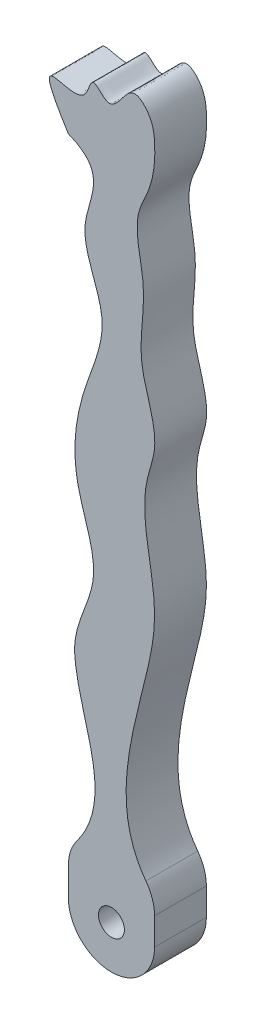
ISO-10303-21;
HEADER;
FILE_DESCRIPTION(('STEP AP214'),'2;1');
FILE_NAME('part.step','',(''),(''),'','','');
FILE_SCHEMA(('AUTOMOTIVE_DESIGN { 1 0 10303 214 1 1 1 1 }'));
ENDSEC;
DATA;
#1=APPLICATION_CONTEXT('core data for automotive mechanical design processes');
#2=APPLICATION_PROTOCOL_DEFINITION('international standard','automotive_design',2000,#1);
#3=PRODUCT_CONTEXT('',#1,'mechanical');
#4=PRODUCT('Part','Part','',(#3));
#5=PRODUCT_RELATED_PRODUCT_CATEGORY('part','',(#4));
#6=PRODUCT_DEFINITION_FORMATION('','',#4);
#7=PRODUCT_DEFINITION_CONTEXT('part definition',#1,'design');
#8=PRODUCT_DEFINITION('design','',#6,#7);
#9=PRODUCT_DEFINITION_SHAPE('','',#8);
#10=(LENGTH_UNIT() NAMED_UNIT(*) SI_UNIT(.MILLI.,.METRE.));
#11=(NAMED_UNIT(*) PLANE_ANGLE_UNIT() SI_UNIT($,.RADIAN.));
#12=(NAMED_UNIT(*) SI_UNIT($,.STERADIAN.) SOLID_ANGLE_UNIT());
#13=UNCERTAINTY_MEASURE_WITH_UNIT(LENGTH_MEASURE(1.E-05),#10,'distance_accuracy_value','');
#14=(GEOMETRIC_REPRESENTATION_CONTEXT(3) GLOBAL_UNCERTAINTY_ASSIGNED_CONTEXT((#13)) GLOBAL_UNIT_ASSIGNED_CONTEXT((#10,
#11,#12)) REPRESENTATION_CONTEXT('',''));
#15=CARTESIAN_POINT('',(0.,0.,0.));
#16=DIRECTION('',(0.,0.,1.));
#17=DIRECTION('',(1.,0.,0.));
#18=AXIS2_PLACEMENT_3D('',#15,#16,#17);
#19=CARTESIAN_POINT('',(4.07432307287909,27.0040889400727,6.));
#20=DIRECTION('',(0.,0.,1.));
#21=DIRECTION('',(1.,0.,0.));
#22=AXIS2_PLACEMENT_3D('',#19,#20,#21);
#23=PLANE('',#22);
#24=CARTESIAN_POINT('',(4.99,-4.99,6.));
#25=DIRECTION('',(0.,0.,1.));
#26=DIRECTION('',(1.,0.,0.));
#27=AXIS2_PLACEMENT_3D('',#24,#25,#26);
#28=CIRCLE('',#27,1.5);
#29=CARTESIAN_POINT('',(6.49,-4.99,6.));
#30=VERTEX_POINT('',#29);
#31=EDGE_CURVE('E267',#30,#30,#28,.T.);
#32=ORIENTED_EDGE('',*,*,#31,.F.);
#33=EDGE_LOOP('',(#32));
#34=FACE_BOUND('',#33,.T.);
#35=DIRECTION('',(0.,1.,0.));
#36=VECTOR('',#35,1.);
#37=CARTESIAN_POINT('',(9.98,0.,6.));
#38=LINE('',#37,#36);
#39=CARTESIAN_POINT('',(9.98,-4.99,6.));
#40=VERTEX_POINT('',#39);
#41=CARTESIAN_POINT('',(9.98,-1.84366873367898,6.));
#42=VERTEX_POINT('',#41);
#43=EDGE_CURVE('E143',#40,#42,#38,.T.);
#44=ORIENTED_EDGE('',*,*,#43,.T.);
#45=CARTESIAN_POINT('',(4.98,-1.84366873367898,6.));
#46=DIRECTION('',(0.,0.,1.));
#47=DIRECTION('',(1.,0.,0.));
#48=AXIS2_PLACEMENT_3D('',#45,#46,#47);
#49=CIRCLE('',#48,5.);
#50=CARTESIAN_POINT('',(8.98098100878048,1.15502280887385,6.));
#51=VERTEX_POINT('',#50);
#52=EDGE_CURVE('E299',#42,#51,#49,.T.);
#53=ORIENTED_EDGE('',*,*,#52,.T.);
#54=CARTESIAN_POINT('',(0.,71.5650155719996,6.));
#55=CARTESIAN_POINT('',(-5.23348107052587,79.9076116564832,6.));
#56=CARTESIAN_POINT('',(1.76861581274312,73.0948712639177,6.));
#57=CARTESIAN_POINT('',(2.67028692862513,79.1568770275505,6.));
#58=CARTESIAN_POINT('',(5.22304293118502,75.3266328469316,6.));
#59=CARTESIAN_POINT('',(6.95630672094599,80.779428566184,6.));
#60=CARTESIAN_POINT('',(9.7237738299482,77.9960982388825,6.));
#61=CARTESIAN_POINT('',(10.1600572462268,74.8960421468875,6.));
#62=CARTESIAN_POINT('',(9.84483703790709,71.2010889508699,6.));
#63=CARTESIAN_POINT('',(7.18888822312384,66.6374369105406,6.));
#64=CARTESIAN_POINT('',(9.49319090001314,60.3691965149892,6.));
#65=CARTESIAN_POINT('',(7.47094063330744,52.8017717005574,6.));
#66=CARTESIAN_POINT('',(10.8925576927519,46.3282596734939,6.));
#67=CARTESIAN_POINT('',(7.67948493558091,38.4277530219315,6.));
#68=CARTESIAN_POINT('',(10.9607769378451,30.1273973636887,6.));
#69=CARTESIAN_POINT('',(7.84195569530145,16.6039575659587,6.));
#70=CARTESIAN_POINT('',(4.62250046719013,5.40141243116943,6.));
#71=CARTESIAN_POINT('',(9.97999999999999,0.,6.));
#72=B_SPLINE_CURVE_WITH_KNOTS('',3,(#54,#55,#56,#57,#58,#59,#60,#61,#62,#63,#64,#65,#66,#67,#68,
#69,#70,#71),.UNSPECIFIED.,.F.,.F.,(4,1,1,1,1,1,1,1,1,1,1,1,1,1,1,4),(0.,0.0748046004819373,
0.0943656239613911,0.114748154482906,0.154560578283164,0.178597200692737,0.20232402340862,
0.255569531192657,0.28854750507143,0.360702051299538,0.443388281836509,0.525057153622352,
0.564586382830383,0.697373731389165,0.77628332170053,1.),.UNSPECIFIED.);
#73=CARTESIAN_POINT('',(9.98,28.1320456499708,6.));
#74=VERTEX_POINT('',#73);
#75=EDGE_CURVE('E202',#74,#51,#72,.T.);
#76=ORIENTED_EDGE('',*,*,#75,.F.);
#77=CARTESIAN_POINT('',(9.98,28.5122713338614,6.));
#78=CARTESIAN_POINT('',(9.98149863752208,28.385388264433,6.));
#79=CARTESIAN_POINT('',(9.98147607811895,28.2586541660967,6.));
#80=CARTESIAN_POINT('',(9.97999999999932,28.1320456499708,6.));
#81=B_SPLINE_CURVE_WITH_KNOTS('',3,(#77,#78,#79,#80),.UNSPECIFIED.,.F.,.F.,(4,4),
(0.298635868241471,0.302626268610835),.UNSPECIFIED.);
#82=CARTESIAN_POINT('',(9.98,28.5122713338714,6.));
#83=VERTEX_POINT('',#82);
#84=EDGE_CURVE('E151',#74,#83,#81,.F.);
#85=ORIENTED_EDGE('',*,*,#84,.T.);
#86=CARTESIAN_POINT('',(9.98,0.,6.));
#87=CARTESIAN_POINT('',(4.62250046719011,5.40141243116942,6.));
#88=CARTESIAN_POINT('',(7.84195569530145,16.6039575659587,6.));
#89=CARTESIAN_POINT('',(10.9607769378451,30.1273973636887,6.));
#90=CARTESIAN_POINT('',(7.67948493558091,38.4277530219314,6.));
#91=CARTESIAN_POINT('',(10.8925576927519,46.3282596734939,6.));
#92=CARTESIAN_POINT('',(7.47094063330744,52.8017717005574,6.));
#93=CARTESIAN_POINT('',(9.49319090001314,60.3691965149892,6.));
#94=CARTESIAN_POINT('',(7.18888822312384,66.6374369105406,6.));
#95=CARTESIAN_POINT('',(9.8448370379071,71.2010889508699,6.));
#96=CARTESIAN_POINT('',(10.1600572462268,74.8960421468876,6.));
#97=CARTESIAN_POINT('',(9.7237738299482,77.9960982388825,6.));
#98=CARTESIAN_POINT('',(6.95630672094599,80.779428566184,6.));
#99=CARTESIAN_POINT('',(5.22304293118502,75.3266328469316,6.));
#100=CARTESIAN_POINT('',(2.67028692862513,79.1568770275505,6.));
#101=CARTESIAN_POINT('',(1.76861581274311,73.0948712639177,6.));
#102=CARTESIAN_POINT('',(-5.23348107052587,79.9076116564831,6.));
#103=CARTESIAN_POINT('',(0.,71.5650155719996,6.));
#104=B_SPLINE_CURVE_WITH_KNOTS('',3,(#86,#87,#88,#89,#90,#91,#92,#93,#94,#95,#96,#97,#98,#99,
#100,#101,#102,#103),.UNSPECIFIED.,.F.,.F.,(4,1,1,1,1,1,1,1,1,1,1,1,1,1,1,4),(0.,
0.22371667829947,0.302626268610835,0.435413617169617,0.474942846377647,0.556611718163491,
0.639297948700462,0.71145249492857,0.744430468807343,0.79767597659138,0.821402799307263,
0.845439421716837,0.885251845517094,0.905634376038609,0.925195399518063,1.),.UNSPECIFIED.);
#105=CARTESIAN_POINT('',(0.,71.5650155719996,6.));
#106=VERTEX_POINT('',#105);
#107=EDGE_CURVE('E230',#83,#106,#104,.T.);
#108=ORIENTED_EDGE('',*,*,#107,.T.);
#109=CARTESIAN_POINT('',(0.,71.5650155719996,6.));
#110=CARTESIAN_POINT('',(4.95379874150826,69.5878986572499,6.));
#111=CARTESIAN_POINT('',(-0.349346036381591,63.4928346008607,6.));
#112=CARTESIAN_POINT('',(5.46747409240744,55.1455661347434,6.));
#113=CARTESIAN_POINT('',(1.27242754081739,46.5750249363635,6.));
#114=CARTESIAN_POINT('',(-0.0166340129952795,37.4764347168597,6.));
#115=CARTESIAN_POINT('',(4.50908777851613,28.7822913087027,6.));
#116=CARTESIAN_POINT('',(0.375030838020541,22.6222597257897,6.));
#117=CARTESIAN_POINT('',(1.48893672285423,12.7256065749913,6.));
#118=CARTESIAN_POINT('',(5.63606805971561,6.03124587861794,6.));
#119=CARTESIAN_POINT('',(0.,0.,6.));
#120=B_SPLINE_CURVE_WITH_KNOTS('',3,(#109,#110,#111,#112,#113,#114,#115,#116,#117,#118,#119),
.UNSPECIFIED.,.F.,.F.,(4,1,1,1,1,1,1,1,4),(0.,0.126258818588464,0.238720386188479,
0.351181953788495,0.484025061415551,0.603344795023398,0.708762825580807,0.749079210393112,1.),.UNSPECIFIED.);
#121=CARTESIAN_POINT('',(0.993222974569181,1.18325505641431,6.));
#122=VERTEX_POINT('',#121);
#123=EDGE_CURVE('E222',#106,#122,#120,.T.);
#124=ORIENTED_EDGE('',*,*,#123,.T.);
#125=CARTESIAN_POINT('',(5.,-1.80768758236695,6.));
#126=DIRECTION('',(0.,0.,1.));
#127=DIRECTION('',(1.,0.,0.));
#128=AXIS2_PLACEMENT_3D('',#125,#126,#127);
#129=CIRCLE('',#128,5.);
#130=CARTESIAN_POINT('',(0.,-1.80768758236695,6.));
#131=VERTEX_POINT('',#130);
#132=EDGE_CURVE('E68',#122,#131,#129,.T.);
#133=ORIENTED_EDGE('',*,*,#132,.T.);
#134=DIRECTION('',(0.,-1.,0.));
#135=VECTOR('',#134,1.);
#136=CARTESIAN_POINT('',(0.,0.,6.));
#137=LINE('',#136,#135);
#138=CARTESIAN_POINT('',(0.,-4.99,6.));
#139=VERTEX_POINT('',#138);
#140=EDGE_CURVE('E148',#131,#139,#137,.T.);
#141=ORIENTED_EDGE('',*,*,#140,.T.);
#142=CARTESIAN_POINT('',(4.99,-4.99,6.));
#143=DIRECTION('',(0.,0.,1.));
#144=DIRECTION('',(1.,0.,0.));
#145=AXIS2_PLACEMENT_3D('',#142,#143,#144);
#146=CIRCLE('',#145,4.99);
#147=EDGE_CURVE('E135',#139,#40,#146,.T.);
#148=ORIENTED_EDGE('',*,*,#147,.T.);
#149=EDGE_LOOP('',(#44,#53,#76,#85,#108,#124,#133,#141,#148));
#150=FACE_BOUND('',#149,.T.);
#151=ADVANCED_FACE('F53',(#34,#150),#23,.T.);
#152=CARTESIAN_POINT('',(4.07432307287909,27.0040889400727,0.));
#153=DIRECTION('',(0.,0.,1.));
#154=DIRECTION('',(1.,0.,0.));
#155=AXIS2_PLACEMENT_3D('',#152,#153,#154);
#156=PLANE('',#155);
#157=CARTESIAN_POINT('',(4.99,-4.99,0.));
#158=DIRECTION('',(0.,0.,1.));
#159=DIRECTION('',(1.,0.,0.));
#160=AXIS2_PLACEMENT_3D('',#157,#158,#159);
#161=CIRCLE('',#160,1.5);
#162=CARTESIAN_POINT('',(6.49,-4.99,0.));
#163=VERTEX_POINT('',#162);
#164=EDGE_CURVE('E265',#163,#163,#161,.T.);
#165=ORIENTED_EDGE('',*,*,#164,.T.);
#166=EDGE_LOOP('',(#165));
#167=FACE_BOUND('',#166,.T.);
#168=CARTESIAN_POINT('',(0.,71.5650155719996,0.));
#169=CARTESIAN_POINT('',(-5.23348107052587,79.9076116564832,0.));
#170=CARTESIAN_POINT('',(1.76861581274312,73.0948712639177,0.));
#171=CARTESIAN_POINT('',(2.67028692862513,79.1568770275505,0.));
#172=CARTESIAN_POINT('',(5.22304293118502,75.3266328469316,0.));
#173=CARTESIAN_POINT('',(6.95630672094599,80.779428566184,0.));
#174=CARTESIAN_POINT('',(9.7237738299482,77.9960982388825,0.));
#175=CARTESIAN_POINT('',(10.1600572462268,74.8960421468875,0.));
#176=CARTESIAN_POINT('',(9.84483703790709,71.2010889508699,0.));
#177=CARTESIAN_POINT('',(7.18888822312384,66.6374369105406,0.));
#178=CARTESIAN_POINT('',(9.49319090001314,60.3691965149892,0.));
#179=CARTESIAN_POINT('',(7.47094063330744,52.8017717005574,0.));
#180=CARTESIAN_POINT('',(10.8925576927519,46.3282596734939,0.));
#181=CARTESIAN_POINT('',(7.67948493558091,38.4277530219315,0.));
#182=CARTESIAN_POINT('',(10.9607769378451,30.1273973636887,0.));
#183=CARTESIAN_POINT('',(7.84195569530145,16.6039575659587,0.));
#184=CARTESIAN_POINT('',(4.62250046719013,5.40141243116943,0.));
#185=CARTESIAN_POINT('',(9.97999999999999,0.,0.));
#186=B_SPLINE_CURVE_WITH_KNOTS('',3,(#168,#169,#170,#171,#172,#173,#174,#175,#176,#177,#178,
#179,#180,#181,#182,#183,#184,#185),.UNSPECIFIED.,.F.,.F.,(4,1,1,1,1,1,1,1,1,1,1,1,1,1,1,4),(0.,
0.0748046004819373,0.0943656239613911,0.114748154482906,0.154560578283164,0.178597200692737,
0.20232402340862,0.255569531192657,0.28854750507143,0.360702051299538,0.443388281836509,
0.525057153622352,0.564586382830383,0.697373731389165,0.77628332170053,1.),.UNSPECIFIED.);
#187=CARTESIAN_POINT('',(9.97999999999932,28.1320456499708,0.));
#188=VERTEX_POINT('',#187);
#189=CARTESIAN_POINT('',(8.98098100878048,1.15502280887385,0.));
#190=VERTEX_POINT('',#189);
#191=EDGE_CURVE('E195',#188,#190,#186,.T.);
#192=ORIENTED_EDGE('',*,*,#191,.T.);
#193=CARTESIAN_POINT('',(4.98,-1.84366873367898,0.));
#194=DIRECTION('',(0.,0.,1.));
#195=DIRECTION('',(1.,0.,0.));
#196=AXIS2_PLACEMENT_3D('',#193,#194,#195);
#197=CIRCLE('',#196,5.);
#198=CARTESIAN_POINT('',(9.98,-1.84366873367898,0.));
#199=VERTEX_POINT('',#198);
#200=EDGE_CURVE('E147',#190,#199,#197,.F.);
#201=ORIENTED_EDGE('',*,*,#200,.T.);
#202=DIRECTION('',(0.,1.,0.));
#203=VECTOR('',#202,1.);
#204=CARTESIAN_POINT('',(9.98,0.,0.));
#205=LINE('',#204,#203);
#206=CARTESIAN_POINT('',(9.98,-4.99,0.));
#207=VERTEX_POINT('',#206);
#208=EDGE_CURVE('E140',#207,#199,#205,.T.);
#209=ORIENTED_EDGE('',*,*,#208,.F.);
#210=CARTESIAN_POINT('',(4.99,-4.99,0.));
#211=DIRECTION('',(0.,0.,1.));
#212=DIRECTION('',(1.,0.,0.));
#213=AXIS2_PLACEMENT_3D('',#210,#211,#212);
#214=CIRCLE('',#213,4.99);
#215=CARTESIAN_POINT('',(0.,-4.99,0.));
#216=VERTEX_POINT('',#215);
#217=EDGE_CURVE('E124',#216,#207,#214,.T.);
#218=ORIENTED_EDGE('',*,*,#217,.F.);
#219=DIRECTION('',(0.,-1.,0.));
#220=VECTOR('',#219,1.);
#221=CARTESIAN_POINT('',(0.,0.,0.));
#222=LINE('',#221,#220);
#223=CARTESIAN_POINT('',(0.,-1.80768758236695,0.));
#224=VERTEX_POINT('',#223);
#225=EDGE_CURVE('E154',#224,#216,#222,.T.);
#226=ORIENTED_EDGE('',*,*,#225,.F.);
#227=CARTESIAN_POINT('',(5.,-1.80768758236695,0.));
#228=DIRECTION('',(0.,0.,1.));
#229=DIRECTION('',(1.,0.,0.));
#230=AXIS2_PLACEMENT_3D('',#227,#228,#229);
#231=CIRCLE('',#230,5.);
#232=CARTESIAN_POINT('',(0.993222974569181,1.18325505641431,0.));
#233=VERTEX_POINT('',#232);
#234=EDGE_CURVE('E292',#224,#233,#231,.F.);
#235=ORIENTED_EDGE('',*,*,#234,.T.);
#236=CARTESIAN_POINT('',(0.,71.5650155719996,0.));
#237=CARTESIAN_POINT('',(4.95379874150826,69.5878986572499,0.));
#238=CARTESIAN_POINT('',(-0.349346036381591,63.4928346008607,0.));
#239=CARTESIAN_POINT('',(5.46747409240744,55.1455661347434,0.));
#240=CARTESIAN_POINT('',(1.27242754081739,46.5750249363635,0.));
#241=CARTESIAN_POINT('',(-0.0166340129952795,37.4764347168597,0.));
#242=CARTESIAN_POINT('',(4.50908777851613,28.7822913087027,0.));
#243=CARTESIAN_POINT('',(0.375030838020541,22.6222597257897,0.));
#244=CARTESIAN_POINT('',(1.48893672285423,12.7256065749913,0.));
#245=CARTESIAN_POINT('',(5.63606805971561,6.03124587861794,0.));
#246=CARTESIAN_POINT('',(0.,0.,0.));
#247=B_SPLINE_CURVE_WITH_KNOTS('',3,(#236,#237,#238,#239,#240,#241,#242,#243,#244,#245,#246),
.UNSPECIFIED.,.F.,.F.,(4,1,1,1,1,1,1,1,4),(0.,0.126258818588464,0.238720386188479,
0.351181953788495,0.484025061415551,0.603344795023398,0.708762825580807,0.749079210393112,1.),.UNSPECIFIED.);
#248=CARTESIAN_POINT('',(0.,71.5650155719996,0.));
#249=VERTEX_POINT('',#248);
#250=EDGE_CURVE('E213',#249,#233,#247,.T.);
#251=ORIENTED_EDGE('',*,*,#250,.F.);
#252=CARTESIAN_POINT('',(9.98,0.,0.));
#253=CARTESIAN_POINT('',(4.62250046719011,5.40141243116942,0.));
#254=CARTESIAN_POINT('',(7.84195569530145,16.6039575659587,0.));
#255=CARTESIAN_POINT('',(10.9607769378451,30.1273973636887,0.));
#256=CARTESIAN_POINT('',(7.67948493558091,38.4277530219314,0.));
#257=CARTESIAN_POINT('',(10.8925576927519,46.3282596734939,0.));
#258=CARTESIAN_POINT('',(7.47094063330744,52.8017717005574,0.));
#259=CARTESIAN_POINT('',(9.49319090001314,60.3691965149892,0.));
#260=CARTESIAN_POINT('',(7.18888822312384,66.6374369105406,0.));
#261=CARTESIAN_POINT('',(9.8448370379071,71.2010889508699,0.));
#262=CARTESIAN_POINT('',(10.1600572462268,74.8960421468876,0.));
#263=CARTESIAN_POINT('',(9.7237738299482,77.9960982388825,0.));
#264=CARTESIAN_POINT('',(6.95630672094599,80.779428566184,0.));
#265=CARTESIAN_POINT('',(5.22304293118502,75.3266328469316,0.));
#266=CARTESIAN_POINT('',(2.67028692862513,79.1568770275505,0.));
#267=CARTESIAN_POINT('',(1.76861581274311,73.0948712639177,0.));
#268=CARTESIAN_POINT('',(-5.23348107052587,79.9076116564831,0.));
#269=CARTESIAN_POINT('',(0.,71.5650155719996,0.));
#270=B_SPLINE_CURVE_WITH_KNOTS('',3,(#252,#253,#254,#255,#256,#257,#258,#259,#260,#261,#262,
#263,#264,#265,#266,#267,#268,#269),.UNSPECIFIED.,.F.,.F.,(4,1,1,1,1,1,1,1,1,1,1,1,1,1,1,4),(0.,
0.22371667829947,0.302626268610835,0.435413617169617,0.474942846377647,0.556611718163491,
0.639297948700462,0.71145249492857,0.744430468807343,0.79767597659138,0.821402799307263,
0.845439421716837,0.885251845517094,0.905634376038609,0.925195399518063,1.),.UNSPECIFIED.);
#271=CARTESIAN_POINT('',(9.98,28.512271333938,0.));
#272=VERTEX_POINT('',#271);
#273=EDGE_CURVE('E214',#272,#249,#270,.T.);
#274=ORIENTED_EDGE('',*,*,#273,.F.);
#275=CARTESIAN_POINT('',(9.97999999999932,28.1320456499708,0.));
#276=CARTESIAN_POINT('',(9.98147607811895,28.2586541660967,0.));
#277=CARTESIAN_POINT('',(9.98149863752208,28.385388264433,0.));
#278=CARTESIAN_POINT('',(9.98,28.5122713338614,0.));
#279=B_SPLINE_CURVE_WITH_KNOTS('',3,(#275,#276,#277,#278),.UNSPECIFIED.,.F.,.F.,(4,4),
(0.298635868241471,0.302626268610835),.UNSPECIFIED.);
#280=EDGE_CURVE('E149',#188,#272,#279,.T.);
#281=ORIENTED_EDGE('',*,*,#280,.F.);
#282=EDGE_LOOP('',(#192,#201,#209,#218,#226,#235,#251,#274,#281));
#283=FACE_BOUND('',#282,.T.);
#284=ADVANCED_FACE('F146',(#167,#283),#156,.F.);
#285=CARTESIAN_POINT('',(9.98,0.,6.));
#286=DIRECTION('',(-1.,0.,0.));
#287=DIRECTION('',(0.,0.,1.));
#288=AXIS2_PLACEMENT_3D('',#285,#286,#287);
#289=PLANE('',#288);
#290=ORIENTED_EDGE('',*,*,#208,.T.);
#291=DIRECTION('',(0.,0.,-1.));
#292=VECTOR('',#291,1.);
#293=CARTESIAN_POINT('',(9.98,-1.84366873367898,6.));
#294=LINE('',#293,#292);
#295=EDGE_CURVE('E294',#199,#42,#294,.F.);
#296=ORIENTED_EDGE('',*,*,#295,.T.);
#297=ORIENTED_EDGE('',*,*,#43,.F.);
#298=DIRECTION('',(0.,0.,1.));
#299=VECTOR('',#298,1.);
#300=CARTESIAN_POINT('',(9.98,-4.99,0.));
#301=LINE('',#300,#299);
#302=EDGE_CURVE('E128',#207,#40,#301,.T.);
#303=ORIENTED_EDGE('',*,*,#302,.F.);
#304=EDGE_LOOP('',(#290,#296,#297,#303));
#305=FACE_BOUND('',#304,.T.);
#306=ADVANCED_FACE('F139',(#305),#289,.F.);
#307=CARTESIAN_POINT('',(0.,0.,6.));
#308=DIRECTION('',(1.,0.,0.));
#309=DIRECTION('',(0.,1.,0.));
#310=AXIS2_PLACEMENT_3D('',#307,#308,#309);
#311=PLANE('',#310);
#312=ORIENTED_EDGE('',*,*,#140,.F.);
#313=DIRECTION('',(0.,0.,-1.));
#314=VECTOR('',#313,1.);
#315=CARTESIAN_POINT('',(0.,-1.80768758236695,6.));
#316=LINE('',#315,#314);
#317=EDGE_CURVE('E61',#131,#224,#316,.T.);
#318=ORIENTED_EDGE('',*,*,#317,.T.);
#319=ORIENTED_EDGE('',*,*,#225,.T.);
#320=DIRECTION('',(0.,0.,1.));
#321=VECTOR('',#320,1.);
#322=CARTESIAN_POINT('',(0.,-4.99,0.));
#323=LINE('',#322,#321);
#324=EDGE_CURVE('E131',#216,#139,#323,.T.);
#325=ORIENTED_EDGE('',*,*,#324,.T.);
#326=EDGE_LOOP('',(#312,#318,#319,#325));
#327=FACE_BOUND('',#326,.T.);
#328=ADVANCED_FACE('F303',(#327),#311,.F.);
#329=CARTESIAN_POINT('',(4.99,-4.99,6.));
#330=DIRECTION('',(0.,0.,-1.));
#331=DIRECTION('',(-1.,0.,0.));
#332=AXIS2_PLACEMENT_3D('',#329,#330,#331);
#333=CYLINDRICAL_SURFACE('',#332,1.5);
#334=ORIENTED_EDGE('',*,*,#31,.T.);
#335=EDGE_LOOP('',(#334));
#336=FACE_BOUND('',#335,.T.);
#337=ORIENTED_EDGE('',*,*,#164,.F.);
#338=EDGE_LOOP('',(#337));
#339=FACE_BOUND('',#338,.T.);
#340=ADVANCED_FACE('F185',(#336,#339),#333,.F.);
#341=DIRECTION('',(0.,0.,1.));
#342=VECTOR('',#341,1.);
#343=SURFACE_OF_LINEAR_EXTRUSION('',#270,#342);
#344=ORIENTED_EDGE('',*,*,#75,.T.);
#345=DIRECTION('',(0.,0.,1.));
#346=VECTOR('',#345,1.);
#347=CARTESIAN_POINT('',(8.98098100878048,1.15502280887385,6.));
#348=LINE('',#347,#346);
#349=EDGE_CURVE('E160',#51,#190,#348,.F.);
#350=ORIENTED_EDGE('',*,*,#349,.T.);
#351=ORIENTED_EDGE('',*,*,#191,.F.);
#352=ORIENTED_EDGE('',*,*,#280,.T.);
#353=ORIENTED_EDGE('',*,*,#273,.T.);
#354=DIRECTION('',(0.,0.,1.));
#355=VECTOR('',#354,1.);
#356=CARTESIAN_POINT('',(0.,71.5650155719996,0.));
#357=LINE('',#356,#355);
#358=EDGE_CURVE('E258',#249,#106,#357,.T.);
#359=ORIENTED_EDGE('',*,*,#358,.T.);
#360=ORIENTED_EDGE('',*,*,#107,.F.);
#361=ORIENTED_EDGE('',*,*,#84,.F.);
#362=EDGE_LOOP('',(#344,#350,#351,#352,#353,#359,#360,#361));
#363=FACE_BOUND('',#362,.T.);
#364=ADVANCED_FACE('F240',(#363),#343,.T.);
#365=DIRECTION('',(0.,0.,-1.));
#366=VECTOR('',#365,1.);
#367=SURFACE_OF_LINEAR_EXTRUSION('',#120,#366);
#368=ORIENTED_EDGE('',*,*,#250,.T.);
#369=DIRECTION('',(0.,0.,-1.));
#370=VECTOR('',#369,1.);
#371=CARTESIAN_POINT('',(0.993222974569247,1.1832550564144,0.));
#372=LINE('',#371,#370);
#373=EDGE_CURVE('E12',#233,#122,#372,.F.);
#374=ORIENTED_EDGE('',*,*,#373,.T.);
#375=ORIENTED_EDGE('',*,*,#123,.F.);
#376=ORIENTED_EDGE('',*,*,#358,.F.);
#377=EDGE_LOOP('',(#368,#374,#375,#376));
#378=FACE_BOUND('',#377,.T.);
#379=ADVANCED_FACE('F237',(#378),#367,.F.);
#380=CARTESIAN_POINT('',(4.99,-4.99,0.));
#381=DIRECTION('',(0.,0.,1.));
#382=DIRECTION('',(1.,0.,0.));
#383=AXIS2_PLACEMENT_3D('',#380,#381,#382);
#384=CYLINDRICAL_SURFACE('',#383,4.99);
#385=ORIENTED_EDGE('',*,*,#147,.F.);
#386=ORIENTED_EDGE('',*,*,#324,.F.);
#387=ORIENTED_EDGE('',*,*,#217,.T.);
#388=ORIENTED_EDGE('',*,*,#302,.T.);
#389=EDGE_LOOP('',(#385,#386,#387,#388));
#390=FACE_BOUND('',#389,.T.);
#391=ADVANCED_FACE('F127',(#390),#384,.T.);
#392=CARTESIAN_POINT('',(4.98,-1.84366873367898,3.));
#393=DIRECTION('',(0.,0.,1.));
#394=DIRECTION('',(1.,0.,0.));
#395=AXIS2_PLACEMENT_3D('',#392,#393,#394);
#396=CYLINDRICAL_SURFACE('',#395,5.);
#397=ORIENTED_EDGE('',*,*,#52,.F.);
#398=ORIENTED_EDGE('',*,*,#295,.F.);
#399=ORIENTED_EDGE('',*,*,#200,.F.);
#400=ORIENTED_EDGE('',*,*,#349,.F.);
#401=EDGE_LOOP('',(#397,#398,#399,#400));
#402=FACE_BOUND('',#401,.T.);
#403=ADVANCED_FACE('F306',(#402),#396,.T.);
#404=CARTESIAN_POINT('',(5.,-1.80768758236695,3.));
#405=DIRECTION('',(0.,0.,-1.));
#406=DIRECTION('',(-1.,0.,0.));
#407=AXIS2_PLACEMENT_3D('',#404,#405,#406);
#408=CYLINDRICAL_SURFACE('',#407,5.);
#409=ORIENTED_EDGE('',*,*,#132,.F.);
#410=ORIENTED_EDGE('',*,*,#373,.F.);
#411=ORIENTED_EDGE('',*,*,#234,.F.);
#412=ORIENTED_EDGE('',*,*,#317,.F.);
#413=EDGE_LOOP('',(#409,#410,#411,#412));
#414=FACE_BOUND('',#413,.T.);
#415=ADVANCED_FACE('F55',(#414),#408,.T.);
#416=CLOSED_SHELL('',(#151,#284,#306,#328,#340,#364,#379,#391,#403,#415));
#417=MANIFOLD_SOLID_BREP('B2',#416);
#418=ADVANCED_BREP_SHAPE_REPRESENTATION('',(#18,#417),#14);
#419=SHAPE_DEFINITION_REPRESENTATION(#9,#418);
ENDSEC;
END-ISO-10303-21;
